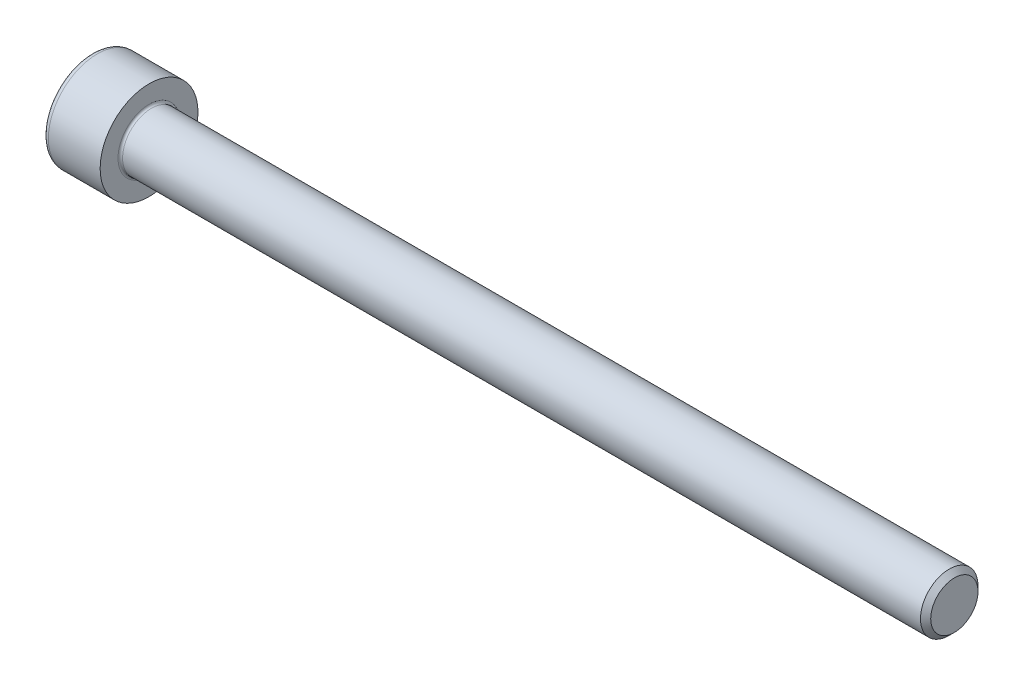
ISO-10303-21;
HEADER;
FILE_DESCRIPTION(('STEP AP214'),'2;1');
FILE_NAME('part.step','',(''),(''),'','','');
FILE_SCHEMA(('AUTOMOTIVE_DESIGN { 1 0 10303 214 1 1 1 1 }'));
ENDSEC;
DATA;
#1=APPLICATION_CONTEXT('core data for automotive mechanical design processes');
#2=APPLICATION_PROTOCOL_DEFINITION('international standard','automotive_design',2000,#1);
#3=PRODUCT_CONTEXT('',#1,'mechanical');
#4=PRODUCT('Part','Part','',(#3));
#5=PRODUCT_RELATED_PRODUCT_CATEGORY('part','',(#4));
#6=PRODUCT_DEFINITION_FORMATION('','',#4);
#7=PRODUCT_DEFINITION_CONTEXT('part definition',#1,'design');
#8=PRODUCT_DEFINITION('design','',#6,#7);
#9=PRODUCT_DEFINITION_SHAPE('','',#8);
#10=(LENGTH_UNIT() NAMED_UNIT(*) SI_UNIT(.MILLI.,.METRE.));
#11=(NAMED_UNIT(*) PLANE_ANGLE_UNIT() SI_UNIT($,.RADIAN.));
#12=(NAMED_UNIT(*) SI_UNIT($,.STERADIAN.) SOLID_ANGLE_UNIT());
#13=UNCERTAINTY_MEASURE_WITH_UNIT(LENGTH_MEASURE(1.E-05),#10,'distance_accuracy_value','');
#14=(GEOMETRIC_REPRESENTATION_CONTEXT(3) GLOBAL_UNCERTAINTY_ASSIGNED_CONTEXT((#13)) GLOBAL_UNIT_ASSIGNED_CONTEXT((#10,
#11,#12)) REPRESENTATION_CONTEXT('',''));
#15=CARTESIAN_POINT('',(0.,0.,0.));
#16=DIRECTION('',(0.,0.,1.));
#17=DIRECTION('',(1.,0.,0.));
#18=AXIS2_PLACEMENT_3D('',#15,#16,#17);
#19=CARTESIAN_POINT('',(0.,0.,0.));
#20=DIRECTION('',(-1.,0.,0.));
#21=DIRECTION('',(0.,0.,1.));
#22=AXIS2_PLACEMENT_3D('',#19,#20,#21);
#23=PLANE('',#22);
#24=DIRECTION('',(0.,-0.499999999999999,0.866025403784439));
#25=VECTOR('',#24,1.);
#26=CARTESIAN_POINT('',(0.,2.32094808214229,0.));
#27=LINE('',#26,#25);
#28=CARTESIAN_POINT('',(0.,2.32094808214229,0.));
#29=VERTEX_POINT('',#28);
#30=CARTESIAN_POINT('',(0.,1.16047404107114,2.01));
#31=VERTEX_POINT('',#30);
#32=EDGE_CURVE('E310',#29,#31,#27,.T.);
#33=ORIENTED_EDGE('',*,*,#32,.T.);
#34=DIRECTION('',(0.,1.,0.));
#35=VECTOR('',#34,1.);
#36=CARTESIAN_POINT('',(0.,-1.16047404107115,2.01));
#37=LINE('',#36,#35);
#38=CARTESIAN_POINT('',(0.,-1.16047404107115,2.01));
#39=VERTEX_POINT('',#38);
#40=EDGE_CURVE('E163',#39,#31,#37,.T.);
#41=ORIENTED_EDGE('',*,*,#40,.F.);
#42=DIRECTION('',(0.,-0.500000000000001,-0.866025403784438));
#43=VECTOR('',#42,1.);
#44=CARTESIAN_POINT('',(0.,-1.16047404107115,2.01));
#45=LINE('',#44,#43);
#46=CARTESIAN_POINT('',(0.,-2.3209480821423,0.));
#47=VERTEX_POINT('',#46);
#48=EDGE_CURVE('E315',#39,#47,#45,.T.);
#49=ORIENTED_EDGE('',*,*,#48,.T.);
#50=DIRECTION('',(0.,0.499999999999998,-0.866025403784439));
#51=VECTOR('',#50,1.);
#52=CARTESIAN_POINT('',(0.,-2.3209480821423,0.));
#53=LINE('',#52,#51);
#54=CARTESIAN_POINT('',(0.,-1.16047404107116,-2.01));
#55=VERTEX_POINT('',#54);
#56=EDGE_CURVE('E319',#47,#55,#53,.T.);
#57=ORIENTED_EDGE('',*,*,#56,.T.);
#58=DIRECTION('',(0.,-1.,0.));
#59=VECTOR('',#58,1.);
#60=CARTESIAN_POINT('',(0.,1.16047404107114,-2.01));
#61=LINE('',#60,#59);
#62=CARTESIAN_POINT('',(0.,1.16047404107114,-2.01));
#63=VERTEX_POINT('',#62);
#64=EDGE_CURVE('E323',#63,#55,#61,.T.);
#65=ORIENTED_EDGE('',*,*,#64,.F.);
#66=DIRECTION('',(0.,-0.500000000000001,-0.866025403784438));
#67=VECTOR('',#66,1.);
#68=CARTESIAN_POINT('',(0.,2.32094808214229,0.));
#69=LINE('',#68,#67);
#70=EDGE_CURVE('E158',#29,#63,#69,.T.);
#71=ORIENTED_EDGE('',*,*,#70,.F.);
#72=EDGE_LOOP('',(#33,#41,#49,#57,#65,#71));
#73=FACE_BOUND('',#72,.T.);
#74=CARTESIAN_POINT('',(0.,0.,0.));
#75=DIRECTION('',(-1.,0.,0.));
#76=DIRECTION('',(0.,0.,1.));
#77=AXIS2_PLACEMENT_3D('',#74,#75,#76);
#78=CIRCLE('',#77,3.75);
#79=CARTESIAN_POINT('',(0.,0.,3.75));
#80=VERTEX_POINT('',#79);
#81=EDGE_CURVE('E54',#80,#80,#78,.T.);
#82=ORIENTED_EDGE('',*,*,#81,.T.);
#83=EDGE_LOOP('',(#82));
#84=FACE_BOUND('',#83,.T.);
#85=ADVANCED_FACE('F45',(#73,#84),#23,.T.);
#86=CARTESIAN_POINT('',(-31.75,0.,0.));
#87=DIRECTION('',(-1.,0.,0.));
#88=DIRECTION('',(0.,0.,1.));
#89=AXIS2_PLACEMENT_3D('',#86,#87,#88);
#90=CYLINDRICAL_SURFACE('',#89,4.25);
#91=CARTESIAN_POINT('',(0.5,0.,0.));
#92=DIRECTION('',(-1.,0.,0.));
#93=DIRECTION('',(0.,0.,1.));
#94=AXIS2_PLACEMENT_3D('',#91,#92,#93);
#95=CIRCLE('',#94,4.25);
#96=CARTESIAN_POINT('',(0.5,0.,4.25));
#97=VERTEX_POINT('',#96);
#98=EDGE_CURVE('E11',#97,#97,#95,.F.);
#99=ORIENTED_EDGE('',*,*,#98,.T.);
#100=EDGE_LOOP('',(#99));
#101=FACE_BOUND('',#100,.T.);
#102=CARTESIAN_POINT('',(5.,0.,0.));
#103=DIRECTION('',(-1.,0.,0.));
#104=DIRECTION('',(0.,0.,1.));
#105=AXIS2_PLACEMENT_3D('',#102,#103,#104);
#106=CIRCLE('',#105,4.25);
#107=CARTESIAN_POINT('',(5.,0.,4.25));
#108=VERTEX_POINT('',#107);
#109=EDGE_CURVE('E189',#108,#108,#106,.T.);
#110=ORIENTED_EDGE('',*,*,#109,.T.);
#111=EDGE_LOOP('',(#110));
#112=FACE_BOUND('',#111,.T.);
#113=ADVANCED_FACE('F218',(#101,#112),#90,.T.);
#114=CARTESIAN_POINT('',(5.,4.25,0.));
#115=DIRECTION('',(1.,0.,0.));
#116=DIRECTION('',(0.,0.,-1.));
#117=AXIS2_PLACEMENT_3D('',#114,#115,#116);
#118=PLANE('',#117);
#119=CARTESIAN_POINT('',(5.,0.,0.));
#120=DIRECTION('',(1.,0.,0.));
#121=DIRECTION('',(0.,0.,-1.));
#122=AXIS2_PLACEMENT_3D('',#119,#120,#121);
#123=CIRCLE('',#122,2.7);
#124=CARTESIAN_POINT('',(5.,0.,-2.7));
#125=VERTEX_POINT('',#124);
#126=EDGE_CURVE('E193',#125,#125,#123,.F.);
#127=ORIENTED_EDGE('',*,*,#126,.T.);
#128=EDGE_LOOP('',(#127));
#129=FACE_BOUND('',#128,.T.);
#130=ORIENTED_EDGE('',*,*,#109,.F.);
#131=EDGE_LOOP('',(#130));
#132=FACE_BOUND('',#131,.T.);
#133=ADVANCED_FACE('F224',(#129,#132),#118,.T.);
#134=CARTESIAN_POINT('',(-31.75,0.,0.));
#135=DIRECTION('',(-1.,0.,0.));
#136=DIRECTION('',(0.,0.,1.));
#137=AXIS2_PLACEMENT_3D('',#134,#135,#136);
#138=CYLINDRICAL_SURFACE('',#137,2.5);
#139=CARTESIAN_POINT('',(5.2,0.,0.));
#140=DIRECTION('',(1.,0.,0.));
#141=DIRECTION('',(0.,0.,-1.));
#142=AXIS2_PLACEMENT_3D('',#139,#140,#141);
#143=CIRCLE('',#142,2.5);
#144=CARTESIAN_POINT('',(5.2,0.,-2.5));
#145=VERTEX_POINT('',#144);
#146=EDGE_CURVE('E197',#145,#145,#143,.T.);
#147=ORIENTED_EDGE('',*,*,#146,.T.);
#148=EDGE_LOOP('',(#147));
#149=FACE_BOUND('',#148,.T.);
#150=CARTESIAN_POINT('',(74.555,0.,0.));
#151=DIRECTION('',(-1.,0.,0.));
#152=DIRECTION('',(0.,0.,1.));
#153=AXIS2_PLACEMENT_3D('',#150,#151,#152);
#154=CIRCLE('',#153,2.49999999999999);
#155=CARTESIAN_POINT('',(74.555,0.,2.49999999999999));
#156=VERTEX_POINT('',#155);
#157=EDGE_CURVE('E185',#156,#156,#154,.T.);
#158=ORIENTED_EDGE('',*,*,#157,.T.);
#159=EDGE_LOOP('',(#158));
#160=FACE_BOUND('',#159,.T.);
#161=ADVANCED_FACE('F230',(#149,#160),#138,.T.);
#162=CARTESIAN_POINT('',(75.,0.,0.));
#163=DIRECTION('',(-1.,0.,0.));
#164=DIRECTION('',(0.,0.,1.));
#165=AXIS2_PLACEMENT_3D('',#162,#163,#164);
#166=CONICAL_SURFACE('',#165,2.055,0.785398163397438);
#167=ORIENTED_EDGE('',*,*,#157,.F.);
#168=EDGE_LOOP('',(#167));
#169=FACE_BOUND('',#168,.T.);
#170=CARTESIAN_POINT('',(75.,0.,0.));
#171=DIRECTION('',(-1.,0.,0.));
#172=DIRECTION('',(0.,0.,1.));
#173=AXIS2_PLACEMENT_3D('',#170,#171,#172);
#174=CIRCLE('',#173,2.055);
#175=CARTESIAN_POINT('',(75.,0.,2.055));
#176=VERTEX_POINT('',#175);
#177=EDGE_CURVE('E180',#176,#176,#174,.T.);
#178=ORIENTED_EDGE('',*,*,#177,.T.);
#179=EDGE_LOOP('',(#178));
#180=FACE_BOUND('',#179,.T.);
#181=ADVANCED_FACE('F234',(#169,#180),#166,.T.);
#182=CARTESIAN_POINT('',(75.,2.055,0.));
#183=DIRECTION('',(1.,0.,0.));
#184=DIRECTION('',(0.,0.,-1.));
#185=AXIS2_PLACEMENT_3D('',#182,#183,#184);
#186=PLANE('',#185);
#187=ORIENTED_EDGE('',*,*,#177,.F.);
#188=EDGE_LOOP('',(#187));
#189=FACE_BOUND('',#188,.T.);
#190=ADVANCED_FACE('F214',(#189),#186,.T.);
#191=CARTESIAN_POINT('',(5.2,0.,0.));
#192=DIRECTION('',(1.,0.,0.));
#193=DIRECTION('',(0.,0.,-1.));
#194=AXIS2_PLACEMENT_3D('',#191,#192,#193);
#195=TOROIDAL_SURFACE('',#194,2.7,0.2);
#196=ORIENTED_EDGE('',*,*,#146,.F.);
#197=EDGE_LOOP('',(#196));
#198=FACE_BOUND('',#197,.T.);
#199=ORIENTED_EDGE('',*,*,#126,.F.);
#200=EDGE_LOOP('',(#199));
#201=FACE_BOUND('',#200,.T.);
#202=ADVANCED_FACE('F207',(#198,#201),#195,.F.);
#203=CARTESIAN_POINT('',(0.5,0.,0.));
#204=DIRECTION('',(-1.,0.,0.));
#205=DIRECTION('',(0.,0.,1.));
#206=AXIS2_PLACEMENT_3D('',#203,#204,#205);
#207=TOROIDAL_SURFACE('',#206,3.75,0.5);
#208=ORIENTED_EDGE('',*,*,#98,.F.);
#209=EDGE_LOOP('',(#208));
#210=FACE_BOUND('',#209,.T.);
#211=ORIENTED_EDGE('',*,*,#81,.F.);
#212=EDGE_LOOP('',(#211));
#213=FACE_BOUND('',#212,.T.);
#214=ADVANCED_FACE('F47',(#210,#213),#207,.T.);
#215=CARTESIAN_POINT('',(2.5,2.32094808214229,0.));
#216=DIRECTION('',(0.,-0.866025403784439,-0.499999999999999));
#217=DIRECTION('',(0.,0.499999999999999,-0.866025403784439));
#218=AXIS2_PLACEMENT_3D('',#215,#216,#217);
#219=PLANE('',#218);
#220=ORIENTED_EDGE('',*,*,#32,.F.);
#221=DIRECTION('',(-1.,0.,0.));
#222=VECTOR('',#221,1.);
#223=CARTESIAN_POINT('',(2.5,2.32094808214229,0.));
#224=LINE('',#223,#222);
#225=CARTESIAN_POINT('',(2.5,2.32094808214229,0.));
#226=VERTEX_POINT('',#225);
#227=EDGE_CURVE('E295',#226,#29,#224,.T.);
#228=ORIENTED_EDGE('',*,*,#227,.F.);
#229=DIRECTION('',(0.,-0.499999999999999,0.866025403784439));
#230=VECTOR('',#229,1.);
#231=CARTESIAN_POINT('',(2.5,2.32094808214229,0.));
#232=LINE('',#231,#230);
#233=CARTESIAN_POINT('',(2.5,1.74071106160672,1.00499999999999));
#234=VERTEX_POINT('',#233);
#235=EDGE_CURVE('E149',#226,#234,#232,.T.);
#236=ORIENTED_EDGE('',*,*,#235,.T.);
#237=CARTESIAN_POINT('',(2.5,1.16047404107114,2.01));
#238=VERTEX_POINT('',#237);
#239=EDGE_CURVE('E139',#234,#238,#232,.T.);
#240=ORIENTED_EDGE('',*,*,#239,.T.);
#241=DIRECTION('',(-1.,0.,0.));
#242=VECTOR('',#241,1.);
#243=CARTESIAN_POINT('',(2.5,1.16047404107114,2.01));
#244=LINE('',#243,#242);
#245=EDGE_CURVE('E154',#238,#31,#244,.T.);
#246=ORIENTED_EDGE('',*,*,#245,.T.);
#247=EDGE_LOOP('',(#220,#228,#236,#240,#246));
#248=FACE_BOUND('',#247,.T.);
#249=ADVANCED_FACE('F153',(#248),#219,.T.);
#250=CARTESIAN_POINT('',(2.5,-1.16047404107115,2.01));
#251=DIRECTION('',(0.,0.,1.));
#252=DIRECTION('',(0.,-1.,0.));
#253=AXIS2_PLACEMENT_3D('',#250,#251,#252);
#254=PLANE('',#253);
#255=ORIENTED_EDGE('',*,*,#40,.T.);
#256=ORIENTED_EDGE('',*,*,#245,.F.);
#257=DIRECTION('',(0.,1.,0.));
#258=VECTOR('',#257,1.);
#259=CARTESIAN_POINT('',(2.5,-1.16047404107115,2.01));
#260=LINE('',#259,#258);
#261=CARTESIAN_POINT('',(2.5,0.,2.01));
#262=VERTEX_POINT('',#261);
#263=EDGE_CURVE('E136',#262,#238,#260,.T.);
#264=ORIENTED_EDGE('',*,*,#263,.F.);
#265=CARTESIAN_POINT('',(2.5,-1.16047404107115,2.01));
#266=VERTEX_POINT('',#265);
#267=EDGE_CURVE('E148',#266,#262,#260,.T.);
#268=ORIENTED_EDGE('',*,*,#267,.F.);
#269=DIRECTION('',(-1.,0.,0.));
#270=VECTOR('',#269,1.);
#271=CARTESIAN_POINT('',(2.5,-1.16047404107115,2.01));
#272=LINE('',#271,#270);
#273=EDGE_CURVE('E166',#266,#39,#272,.T.);
#274=ORIENTED_EDGE('',*,*,#273,.T.);
#275=EDGE_LOOP('',(#255,#256,#264,#268,#274));
#276=FACE_BOUND('',#275,.T.);
#277=ADVANCED_FACE('F160',(#276),#254,.F.);
#278=CARTESIAN_POINT('',(2.5,-1.16047404107115,2.01));
#279=DIRECTION('',(0.,0.866025403784438,-0.500000000000001));
#280=DIRECTION('',(0.,0.500000000000001,0.866025403784438));
#281=AXIS2_PLACEMENT_3D('',#278,#279,#280);
#282=PLANE('',#281);
#283=ORIENTED_EDGE('',*,*,#48,.F.);
#284=ORIENTED_EDGE('',*,*,#273,.F.);
#285=DIRECTION('',(0.,-0.500000000000001,-0.866025403784438));
#286=VECTOR('',#285,1.);
#287=CARTESIAN_POINT('',(2.5,-1.16047404107115,2.01));
#288=LINE('',#287,#286);
#289=CARTESIAN_POINT('',(2.5,-1.74071106160673,1.00500000000001));
#290=VERTEX_POINT('',#289);
#291=EDGE_CURVE('E351',#266,#290,#288,.T.);
#292=ORIENTED_EDGE('',*,*,#291,.T.);
#293=CARTESIAN_POINT('',(2.5,-2.3209480821423,0.));
#294=VERTEX_POINT('',#293);
#295=EDGE_CURVE('E336',#290,#294,#288,.T.);
#296=ORIENTED_EDGE('',*,*,#295,.T.);
#297=DIRECTION('',(-1.,0.,0.));
#298=VECTOR('',#297,1.);
#299=CARTESIAN_POINT('',(2.5,-2.3209480821423,0.));
#300=LINE('',#299,#298);
#301=EDGE_CURVE('E175',#294,#47,#300,.T.);
#302=ORIENTED_EDGE('',*,*,#301,.T.);
#303=EDGE_LOOP('',(#283,#284,#292,#296,#302));
#304=FACE_BOUND('',#303,.T.);
#305=ADVANCED_FACE('F248',(#304),#282,.T.);
#306=CARTESIAN_POINT('',(2.5,-2.3209480821423,0.));
#307=DIRECTION('',(0.,0.866025403784439,0.499999999999998));
#308=DIRECTION('',(0.,-0.499999999999998,0.86602540378444));
#309=AXIS2_PLACEMENT_3D('',#306,#307,#308);
#310=PLANE('',#309);
#311=ORIENTED_EDGE('',*,*,#56,.F.);
#312=ORIENTED_EDGE('',*,*,#301,.F.);
#313=DIRECTION('',(0.,0.499999999999998,-0.866025403784439));
#314=VECTOR('',#313,1.);
#315=CARTESIAN_POINT('',(2.5,-2.3209480821423,0.));
#316=LINE('',#315,#314);
#317=CARTESIAN_POINT('',(2.5,-1.74071106160673,-1.005));
#318=VERTEX_POINT('',#317);
#319=EDGE_CURVE('E305',#294,#318,#316,.T.);
#320=ORIENTED_EDGE('',*,*,#319,.T.);
#321=CARTESIAN_POINT('',(2.5,-1.16047404107116,-2.01));
#322=VERTEX_POINT('',#321);
#323=EDGE_CURVE('E349',#318,#322,#316,.T.);
#324=ORIENTED_EDGE('',*,*,#323,.T.);
#325=DIRECTION('',(-1.,0.,0.));
#326=VECTOR('',#325,1.);
#327=CARTESIAN_POINT('',(2.5,-1.16047404107116,-2.01));
#328=LINE('',#327,#326);
#329=EDGE_CURVE('E294',#322,#55,#328,.T.);
#330=ORIENTED_EDGE('',*,*,#329,.T.);
#331=EDGE_LOOP('',(#311,#312,#320,#324,#330));
#332=FACE_BOUND('',#331,.T.);
#333=ADVANCED_FACE('F251',(#332),#310,.T.);
#334=CARTESIAN_POINT('',(2.5,1.16047404107114,-2.01));
#335=DIRECTION('',(0.,0.,-1.));
#336=DIRECTION('',(0.,1.,0.));
#337=AXIS2_PLACEMENT_3D('',#334,#335,#336);
#338=PLANE('',#337);
#339=ORIENTED_EDGE('',*,*,#64,.T.);
#340=ORIENTED_EDGE('',*,*,#329,.F.);
#341=DIRECTION('',(0.,-1.,0.));
#342=VECTOR('',#341,1.);
#343=CARTESIAN_POINT('',(2.5,1.16047404107114,-2.01));
#344=LINE('',#343,#342);
#345=CARTESIAN_POINT('',(2.5,0.,-2.01));
#346=VERTEX_POINT('',#345);
#347=EDGE_CURVE('E298',#346,#322,#344,.T.);
#348=ORIENTED_EDGE('',*,*,#347,.F.);
#349=CARTESIAN_POINT('',(2.5,1.16047404107114,-2.01));
#350=VERTEX_POINT('',#349);
#351=EDGE_CURVE('E64',#350,#346,#344,.T.);
#352=ORIENTED_EDGE('',*,*,#351,.F.);
#353=DIRECTION('',(-1.,0.,0.));
#354=VECTOR('',#353,1.);
#355=CARTESIAN_POINT('',(2.5,1.16047404107114,-2.01));
#356=LINE('',#355,#354);
#357=EDGE_CURVE('E290',#350,#63,#356,.T.);
#358=ORIENTED_EDGE('',*,*,#357,.T.);
#359=EDGE_LOOP('',(#339,#340,#348,#352,#358));
#360=FACE_BOUND('',#359,.T.);
#361=ADVANCED_FACE('F255',(#360),#338,.F.);
#362=CARTESIAN_POINT('',(2.5,2.32094808214229,0.));
#363=DIRECTION('',(0.,0.866025403784438,-0.500000000000001));
#364=DIRECTION('',(0.,0.500000000000001,0.866025403784438));
#365=AXIS2_PLACEMENT_3D('',#362,#363,#364);
#366=PLANE('',#365);
#367=ORIENTED_EDGE('',*,*,#70,.T.);
#368=ORIENTED_EDGE('',*,*,#357,.F.);
#369=DIRECTION('',(0.,-0.500000000000001,-0.866025403784438));
#370=VECTOR('',#369,1.);
#371=CARTESIAN_POINT('',(2.5,2.32094808214229,0.));
#372=LINE('',#371,#370);
#373=CARTESIAN_POINT('',(2.5,1.74071106160671,-1.005));
#374=VERTEX_POINT('',#373);
#375=EDGE_CURVE('E280',#374,#350,#372,.T.);
#376=ORIENTED_EDGE('',*,*,#375,.F.);
#377=EDGE_CURVE('E286',#226,#374,#372,.T.);
#378=ORIENTED_EDGE('',*,*,#377,.F.);
#379=ORIENTED_EDGE('',*,*,#227,.T.);
#380=EDGE_LOOP('',(#367,#368,#376,#378,#379));
#381=FACE_BOUND('',#380,.T.);
#382=ADVANCED_FACE('F259',(#381),#366,.F.);
#383=CARTESIAN_POINT('',(2.5,2.32094808214229,0.));
#384=DIRECTION('',(1.,0.,0.));
#385=DIRECTION('',(0.,0.,-1.));
#386=AXIS2_PLACEMENT_3D('',#383,#384,#385);
#387=PLANE('',#386);
#388=ORIENTED_EDGE('',*,*,#347,.T.);
#389=ORIENTED_EDGE('',*,*,#323,.F.);
#390=CARTESIAN_POINT('',(2.5,0.,0.));
#391=DIRECTION('',(-1.,0.,0.));
#392=DIRECTION('',(0.,0.,1.));
#393=AXIS2_PLACEMENT_3D('',#390,#391,#392);
#394=CIRCLE('',#393,2.01);
#395=EDGE_CURVE('E343',#346,#318,#394,.T.);
#396=ORIENTED_EDGE('',*,*,#395,.F.);
#397=EDGE_LOOP('',(#388,#389,#396));
#398=FACE_BOUND('',#397,.T.);
#399=ADVANCED_FACE('F263',(#398),#387,.F.);
#400=ORIENTED_EDGE('',*,*,#319,.F.);
#401=ORIENTED_EDGE('',*,*,#295,.F.);
#402=EDGE_CURVE('E172',#318,#290,#394,.T.);
#403=ORIENTED_EDGE('',*,*,#402,.F.);
#404=EDGE_LOOP('',(#400,#401,#403));
#405=FACE_BOUND('',#404,.T.);
#406=ADVANCED_FACE('F266',(#405),#387,.F.);
#407=ORIENTED_EDGE('',*,*,#291,.F.);
#408=ORIENTED_EDGE('',*,*,#267,.T.);
#409=EDGE_CURVE('E165',#290,#262,#394,.T.);
#410=ORIENTED_EDGE('',*,*,#409,.F.);
#411=EDGE_LOOP('',(#407,#408,#410));
#412=FACE_BOUND('',#411,.T.);
#413=ADVANCED_FACE('F271',(#412),#387,.F.);
#414=ORIENTED_EDGE('',*,*,#263,.T.);
#415=ORIENTED_EDGE('',*,*,#239,.F.);
#416=EDGE_CURVE('E142',#262,#234,#394,.T.);
#417=ORIENTED_EDGE('',*,*,#416,.F.);
#418=EDGE_LOOP('',(#414,#415,#417));
#419=FACE_BOUND('',#418,.T.);
#420=ADVANCED_FACE('F138',(#419),#387,.F.);
#421=ORIENTED_EDGE('',*,*,#235,.F.);
#422=ORIENTED_EDGE('',*,*,#377,.T.);
#423=EDGE_CURVE('E181',#234,#374,#394,.T.);
#424=ORIENTED_EDGE('',*,*,#423,.F.);
#425=EDGE_LOOP('',(#421,#422,#424));
#426=FACE_BOUND('',#425,.T.);
#427=ADVANCED_FACE('F274',(#426),#387,.F.);
#428=ORIENTED_EDGE('',*,*,#375,.T.);
#429=ORIENTED_EDGE('',*,*,#351,.T.);
#430=EDGE_CURVE('E283',#374,#346,#394,.T.);
#431=ORIENTED_EDGE('',*,*,#430,.F.);
#432=EDGE_LOOP('',(#428,#429,#431));
#433=FACE_BOUND('',#432,.T.);
#434=ADVANCED_FACE('F244',(#433),#387,.F.);
#435=CARTESIAN_POINT('',(2.5,0.,0.));
#436=DIRECTION('',(-1.,0.,0.));
#437=DIRECTION('',(0.,0.,1.));
#438=AXIS2_PLACEMENT_3D('',#435,#436,#437);
#439=CONICAL_SURFACE('',#438,2.01,1.04719755119659);
#440=CARTESIAN_POINT('',(3.66047404107116,0.,0.));
#441=VERTEX_POINT('',#440);
#442=VERTEX_LOOP('',#441);
#443=FACE_BOUND('',#442,.T.);
#444=ORIENTED_EDGE('',*,*,#416,.T.);
#445=ORIENTED_EDGE('',*,*,#423,.T.);
#446=ORIENTED_EDGE('',*,*,#430,.T.);
#447=ORIENTED_EDGE('',*,*,#395,.T.);
#448=ORIENTED_EDGE('',*,*,#402,.T.);
#449=ORIENTED_EDGE('',*,*,#409,.T.);
#450=EDGE_LOOP('',(#444,#445,#446,#447,#448,#449));
#451=FACE_BOUND('',#450,.T.);
#452=ADVANCED_FACE('F242',(#443,#451),#439,.F.);
#453=CLOSED_SHELL('',(#85,#113,#133,#161,#181,#190,#202,#214,#249,#277,#305,#333,#361,#382,#399,
#406,#413,#420,#427,#434,#452));
#454=MANIFOLD_SOLID_BREP('B2',#453);
#455=ADVANCED_BREP_SHAPE_REPRESENTATION('',(#18,#454),#14);
#456=SHAPE_DEFINITION_REPRESENTATION(#9,#455);
ENDSEC;
END-ISO-10303-21;
